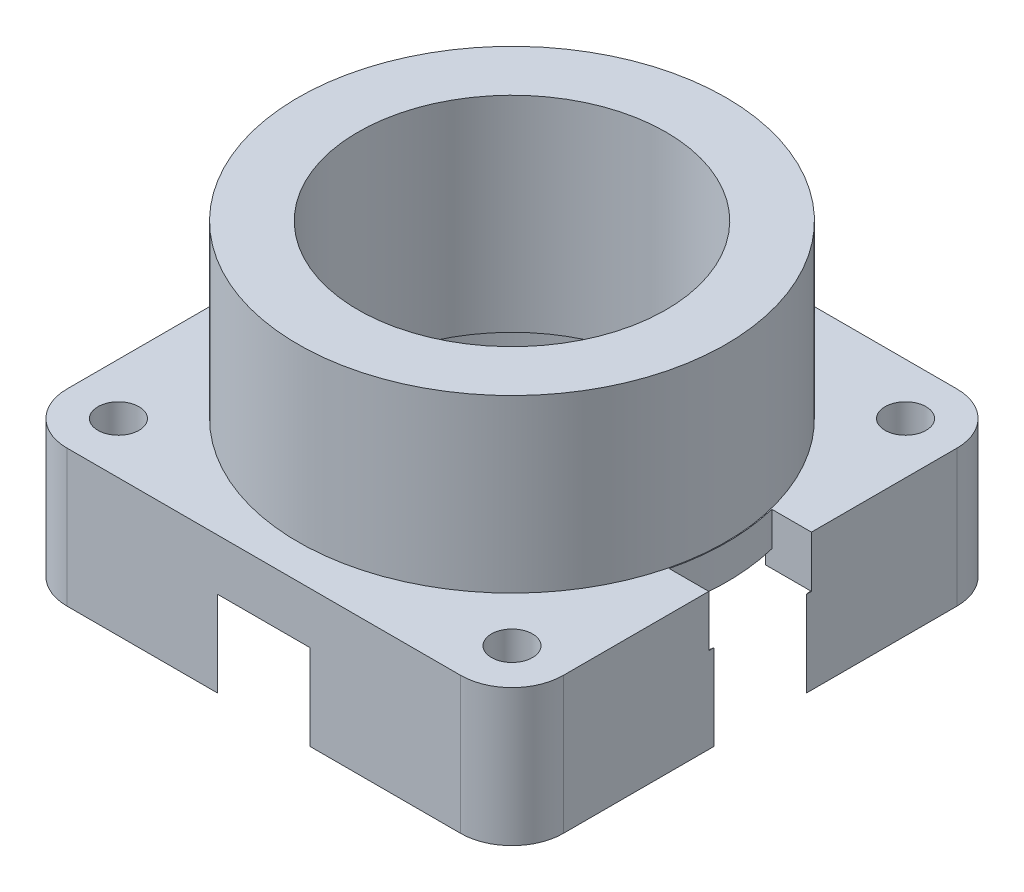
ISO-10303-21;
HEADER;
FILE_DESCRIPTION(('STEP AP214'),'2;1');
FILE_NAME('part.step','',(''),(''),'','','');
FILE_SCHEMA(('AUTOMOTIVE_DESIGN { 1 0 10303 214 1 1 1 1 }'));
ENDSEC;
DATA;
#1=APPLICATION_CONTEXT('core data for automotive mechanical design processes');
#2=APPLICATION_PROTOCOL_DEFINITION('international standard','automotive_design',2000,#1);
#3=PRODUCT_CONTEXT('',#1,'mechanical');
#4=PRODUCT('Part','Part','',(#3));
#5=PRODUCT_RELATED_PRODUCT_CATEGORY('part','',(#4));
#6=PRODUCT_DEFINITION_FORMATION('','',#4);
#7=PRODUCT_DEFINITION_CONTEXT('part definition',#1,'design');
#8=PRODUCT_DEFINITION('design','',#6,#7);
#9=PRODUCT_DEFINITION_SHAPE('','',#8);
#10=(LENGTH_UNIT() NAMED_UNIT(*) SI_UNIT(.MILLI.,.METRE.));
#11=(NAMED_UNIT(*) PLANE_ANGLE_UNIT() SI_UNIT($,.RADIAN.));
#12=(NAMED_UNIT(*) SI_UNIT($,.STERADIAN.) SOLID_ANGLE_UNIT());
#13=UNCERTAINTY_MEASURE_WITH_UNIT(LENGTH_MEASURE(1.E-05),#10,'distance_accuracy_value','');
#14=(GEOMETRIC_REPRESENTATION_CONTEXT(3) GLOBAL_UNCERTAINTY_ASSIGNED_CONTEXT((#13)) GLOBAL_UNIT_ASSIGNED_CONTEXT((#10,
#11,#12)) REPRESENTATION_CONTEXT('',''));
#15=CARTESIAN_POINT('',(0.,0.,0.));
#16=DIRECTION('',(0.,0.,1.));
#17=DIRECTION('',(1.,0.,0.));
#18=AXIS2_PLACEMENT_3D('',#15,#16,#17);
#19=CARTESIAN_POINT('',(0.,-2.,0.));
#20=DIRECTION('',(0.,1.,0.));
#21=DIRECTION('',(0.,0.,1.));
#22=AXIS2_PLACEMENT_3D('',#19,#20,#21);
#23=CYLINDRICAL_SURFACE('',#22,12.2);
#24=CARTESIAN_POINT('',(0.,-8.,0.));
#25=DIRECTION('',(0.,1.,0.));
#26=DIRECTION('',(0.,0.,1.));
#27=AXIS2_PLACEMENT_3D('',#24,#25,#26);
#28=CIRCLE('',#27,12.2);
#29=CARTESIAN_POINT('',(11.8253963992756,-8.,3.));
#30=VERTEX_POINT('',#29);
#31=CARTESIAN_POINT('',(11.8253963992756,-8.,-3.));
#32=VERTEX_POINT('',#31);
#33=EDGE_CURVE('E76',#30,#32,#28,.F.);
#34=ORIENTED_EDGE('',*,*,#33,.F.);
#35=DIRECTION('',(0.,1.,0.));
#36=VECTOR('',#35,1.);
#37=CARTESIAN_POINT('',(11.8253963992756,-2.,3.));
#38=LINE('',#37,#36);
#39=CARTESIAN_POINT('',(11.8253963992756,-9.,3.));
#40=VERTEX_POINT('',#39);
#41=EDGE_CURVE('E253',#30,#40,#38,.F.);
#42=ORIENTED_EDGE('',*,*,#41,.T.);
#43=CARTESIAN_POINT('',(0.,-9.,0.));
#44=DIRECTION('',(0.,1.,0.));
#45=DIRECTION('',(0.,0.,1.));
#46=AXIS2_PLACEMENT_3D('',#43,#44,#45);
#47=CIRCLE('',#46,12.2);
#48=CARTESIAN_POINT('',(11.8253963992756,-9.,-3.));
#49=VERTEX_POINT('',#48);
#50=EDGE_CURVE('E361',#49,#40,#47,.T.);
#51=ORIENTED_EDGE('',*,*,#50,.F.);
#52=DIRECTION('',(0.,1.,0.));
#53=VECTOR('',#52,1.);
#54=CARTESIAN_POINT('',(11.8253963992756,-2.,-3.));
#55=LINE('',#54,#53);
#56=EDGE_CURVE('E245',#49,#32,#55,.T.);
#57=ORIENTED_EDGE('',*,*,#56,.T.);
#58=EDGE_LOOP('',(#34,#42,#51,#57));
#59=FACE_BOUND('',#58,.T.);
#60=ADVANCED_FACE('F53',(#59),#23,.F.);
#61=CARTESIAN_POINT('',(4.5,-6.,3.));
#62=DIRECTION('',(0.,0.,1.));
#63=DIRECTION('',(1.,0.,0.));
#64=AXIS2_PLACEMENT_3D('',#61,#62,#63);
#65=PLANE('',#64);
#66=DIRECTION('',(0.,-1.,0.));
#67=VECTOR('',#66,1.);
#68=CARTESIAN_POINT('',(12.1854903761575,0.,3.));
#69=LINE('',#68,#67);
#70=CARTESIAN_POINT('',(12.1854903761575,-6.,3.));
#71=VERTEX_POINT('',#70);
#72=CARTESIAN_POINT('',(12.1854903761575,-8.,3.));
#73=VERTEX_POINT('',#72);
#74=EDGE_CURVE('E221',#71,#73,#69,.T.);
#75=ORIENTED_EDGE('',*,*,#74,.F.);
#76=DIRECTION('',(1.,0.,0.));
#77=VECTOR('',#76,1.);
#78=CARTESIAN_POINT('',(4.5,-6.,3.));
#79=LINE('',#78,#77);
#80=CARTESIAN_POINT('',(14.5,-6.,3.));
#81=VERTEX_POINT('',#80);
#82=EDGE_CURVE('E243',#71,#81,#79,.T.);
#83=ORIENTED_EDGE('',*,*,#82,.T.);
#84=DIRECTION('',(0.,-1.,0.));
#85=VECTOR('',#84,1.);
#86=CARTESIAN_POINT('',(14.5,-6.,3.));
#87=LINE('',#86,#85);
#88=CARTESIAN_POINT('',(14.5,-9.,3.));
#89=VERTEX_POINT('',#88);
#90=EDGE_CURVE('E234',#81,#89,#87,.T.);
#91=ORIENTED_EDGE('',*,*,#90,.T.);
#92=DIRECTION('',(1.,0.,0.));
#93=VECTOR('',#92,1.);
#94=CARTESIAN_POINT('',(4.5,-9.,3.));
#95=LINE('',#94,#93);
#96=CARTESIAN_POINT('',(14.4416931140362,-9.,3.));
#97=VERTEX_POINT('',#96);
#98=EDGE_CURVE('E242',#97,#89,#95,.T.);
#99=ORIENTED_EDGE('',*,*,#98,.F.);
#100=EDGE_CURVE('E250',#40,#97,#95,.T.);
#101=ORIENTED_EDGE('',*,*,#100,.F.);
#102=ORIENTED_EDGE('',*,*,#41,.F.);
#103=DIRECTION('',(-1.,0.,0.));
#104=VECTOR('',#103,1.);
#105=CARTESIAN_POINT('',(4.5,-8.,3.));
#106=LINE('',#105,#104);
#107=EDGE_CURVE('E68',#73,#30,#106,.T.);
#108=ORIENTED_EDGE('',*,*,#107,.F.);
#109=EDGE_LOOP('',(#75,#83,#91,#99,#101,#102,#108));
#110=FACE_BOUND('',#109,.T.);
#111=ADVANCED_FACE('F437',(#110),#65,.F.);
#112=CARTESIAN_POINT('',(4.5,-6.,-3.));
#113=DIRECTION('',(0.,0.,-1.));
#114=DIRECTION('',(-1.,0.,0.));
#115=AXIS2_PLACEMENT_3D('',#112,#113,#114);
#116=PLANE('',#115);
#117=DIRECTION('',(0.,-1.,0.));
#118=VECTOR('',#117,1.);
#119=CARTESIAN_POINT('',(12.1854903761575,0.,-3.));
#120=LINE('',#119,#118);
#121=CARTESIAN_POINT('',(12.1854903761575,-8.,-3.));
#122=VERTEX_POINT('',#121);
#123=CARTESIAN_POINT('',(12.1854903761575,-6.,-3.));
#124=VERTEX_POINT('',#123);
#125=EDGE_CURVE('E12',#122,#124,#120,.F.);
#126=ORIENTED_EDGE('',*,*,#125,.F.);
#127=DIRECTION('',(1.,0.,0.));
#128=VECTOR('',#127,1.);
#129=CARTESIAN_POINT('',(4.5,-8.,-3.));
#130=LINE('',#129,#128);
#131=EDGE_CURVE('E61',#32,#122,#130,.T.);
#132=ORIENTED_EDGE('',*,*,#131,.F.);
#133=ORIENTED_EDGE('',*,*,#56,.F.);
#134=DIRECTION('',(1.,0.,0.));
#135=VECTOR('',#134,1.);
#136=CARTESIAN_POINT('',(4.5,-9.,-3.));
#137=LINE('',#136,#135);
#138=CARTESIAN_POINT('',(14.4416931140362,-9.,-3.));
#139=VERTEX_POINT('',#138);
#140=EDGE_CURVE('E247',#49,#139,#137,.T.);
#141=ORIENTED_EDGE('',*,*,#140,.T.);
#142=CARTESIAN_POINT('',(14.5,-9.,-3.));
#143=VERTEX_POINT('',#142);
#144=EDGE_CURVE('E248',#139,#143,#137,.T.);
#145=ORIENTED_EDGE('',*,*,#144,.T.);
#146=DIRECTION('',(0.,1.,0.));
#147=VECTOR('',#146,1.);
#148=CARTESIAN_POINT('',(14.5,-6.,-3.));
#149=LINE('',#148,#147);
#150=CARTESIAN_POINT('',(14.5,-6.,-3.));
#151=VERTEX_POINT('',#150);
#152=EDGE_CURVE('E240',#143,#151,#149,.T.);
#153=ORIENTED_EDGE('',*,*,#152,.T.);
#154=DIRECTION('',(1.,0.,0.));
#155=VECTOR('',#154,1.);
#156=CARTESIAN_POINT('',(4.5,-6.,-3.));
#157=LINE('',#156,#155);
#158=EDGE_CURVE('E210',#124,#151,#157,.T.);
#159=ORIENTED_EDGE('',*,*,#158,.F.);
#160=EDGE_LOOP('',(#126,#132,#133,#141,#145,#153,#159));
#161=FACE_BOUND('',#160,.T.);
#162=ADVANCED_FACE('F208',(#161),#116,.F.);
#163=CARTESIAN_POINT('',(14.5,-6.,-14.5));
#164=DIRECTION('',(-1.,0.,0.));
#165=DIRECTION('',(0.,0.,1.));
#166=AXIS2_PLACEMENT_3D('',#163,#164,#165);
#167=PLANE('',#166);
#168=DIRECTION('',(0.,0.,-1.));
#169=VECTOR('',#168,1.);
#170=CARTESIAN_POINT('',(14.5,-6.,-14.5));
#171=LINE('',#170,#169);
#172=CARTESIAN_POINT('',(14.5,-6.,-11.5));
#173=VERTEX_POINT('',#172);
#174=EDGE_CURVE('E354',#151,#173,#171,.T.);
#175=ORIENTED_EDGE('',*,*,#174,.F.);
#176=ORIENTED_EDGE('',*,*,#152,.F.);
#177=DIRECTION('',(0.,0.,-1.));
#178=VECTOR('',#177,1.);
#179=CARTESIAN_POINT('',(14.5,-9.,3.));
#180=LINE('',#179,#178);
#181=CARTESIAN_POINT('',(14.5,-9.,-2.704163456598));
#182=VERTEX_POINT('',#181);
#183=EDGE_CURVE('E237',#182,#143,#180,.T.);
#184=ORIENTED_EDGE('',*,*,#183,.F.);
#185=DIRECTION('',(0.,1.,0.));
#186=VECTOR('',#185,1.);
#187=CARTESIAN_POINT('',(14.5,-14.,-2.70416345659801));
#188=LINE('',#187,#186);
#189=CARTESIAN_POINT('',(14.5,-14.,-2.70416345659801));
#190=VERTEX_POINT('',#189);
#191=EDGE_CURVE('E271',#190,#182,#188,.T.);
#192=ORIENTED_EDGE('',*,*,#191,.F.);
#193=DIRECTION('',(0.,0.,-1.));
#194=VECTOR('',#193,1.);
#195=CARTESIAN_POINT('',(14.5,-14.,-2.70416345659801));
#196=LINE('',#195,#194);
#197=CARTESIAN_POINT('',(14.5,-14.,-11.5));
#198=VERTEX_POINT('',#197);
#199=EDGE_CURVE('E259',#190,#198,#196,.T.);
#200=ORIENTED_EDGE('',*,*,#199,.T.);
#201=DIRECTION('',(0.,-1.,0.));
#202=VECTOR('',#201,1.);
#203=CARTESIAN_POINT('',(14.5,-6.,-11.5));
#204=LINE('',#203,#202);
#205=EDGE_CURVE('E380',#198,#173,#204,.F.);
#206=ORIENTED_EDGE('',*,*,#205,.T.);
#207=EDGE_LOOP('',(#175,#176,#184,#192,#200,#206));
#208=FACE_BOUND('',#207,.T.);
#209=ADVANCED_FACE('F446',(#208),#167,.F.);
#210=CARTESIAN_POINT('',(0.,-9.,0.));
#211=DIRECTION('',(0.,1.,0.));
#212=DIRECTION('',(0.,0.,1.));
#213=AXIS2_PLACEMENT_3D('',#210,#211,#212);
#214=PLANE('',#213);
#215=ORIENTED_EDGE('',*,*,#50,.T.);
#216=ORIENTED_EDGE('',*,*,#100,.T.);
#217=CARTESIAN_POINT('',(0.,-9.,0.));
#218=DIRECTION('',(0.,-1.,0.));
#219=DIRECTION('',(0.,0.,1.));
#220=AXIS2_PLACEMENT_3D('',#217,#218,#219);
#221=CIRCLE('',#220,14.75);
#222=CARTESIAN_POINT('',(2.70416345659801,-9.,14.5));
#223=VERTEX_POINT('',#222);
#224=EDGE_CURVE('E279',#97,#223,#221,.T.);
#225=ORIENTED_EDGE('',*,*,#224,.T.);
#226=DIRECTION('',(1.,0.,0.));
#227=VECTOR('',#226,1.);
#228=CARTESIAN_POINT('',(-14.5,-9.,14.5));
#229=LINE('',#228,#227);
#230=CARTESIAN_POINT('',(-2.70416345659801,-9.,14.5));
#231=VERTEX_POINT('',#230);
#232=EDGE_CURVE('E364',#231,#223,#229,.T.);
#233=ORIENTED_EDGE('',*,*,#232,.F.);
#234=CARTESIAN_POINT('',(0.,-9.,0.));
#235=DIRECTION('',(0.,-1.,0.));
#236=DIRECTION('',(0.,0.,1.));
#237=AXIS2_PLACEMENT_3D('',#234,#235,#236);
#238=CIRCLE('',#237,14.75);
#239=CARTESIAN_POINT('',(-14.5,-9.,2.70416345659801));
#240=VERTEX_POINT('',#239);
#241=EDGE_CURVE('E299',#231,#240,#238,.T.);
#242=ORIENTED_EDGE('',*,*,#241,.T.);
#243=DIRECTION('',(0.,0.,1.));
#244=VECTOR('',#243,1.);
#245=CARTESIAN_POINT('',(-14.5,-9.,-14.5));
#246=LINE('',#245,#244);
#247=CARTESIAN_POINT('',(-14.5,-9.,-2.70416345659801));
#248=VERTEX_POINT('',#247);
#249=EDGE_CURVE('E346',#248,#240,#246,.T.);
#250=ORIENTED_EDGE('',*,*,#249,.F.);
#251=CARTESIAN_POINT('',(0.,-9.,0.));
#252=DIRECTION('',(0.,-1.,0.));
#253=DIRECTION('',(0.,0.,1.));
#254=AXIS2_PLACEMENT_3D('',#251,#252,#253);
#255=CIRCLE('',#254,14.75);
#256=CARTESIAN_POINT('',(-2.70416345659801,-9.,-14.5));
#257=VERTEX_POINT('',#256);
#258=EDGE_CURVE('E318',#248,#257,#255,.T.);
#259=ORIENTED_EDGE('',*,*,#258,.T.);
#260=DIRECTION('',(-1.,0.,0.));
#261=VECTOR('',#260,1.);
#262=CARTESIAN_POINT('',(-14.5,-9.,-14.5));
#263=LINE('',#262,#261);
#264=CARTESIAN_POINT('',(2.704163456598,-9.,-14.5));
#265=VERTEX_POINT('',#264);
#266=EDGE_CURVE('E351',#265,#257,#263,.T.);
#267=ORIENTED_EDGE('',*,*,#266,.F.);
#268=CARTESIAN_POINT('',(0.,-9.,0.));
#269=DIRECTION('',(0.,-1.,0.));
#270=DIRECTION('',(0.,0.,1.));
#271=AXIS2_PLACEMENT_3D('',#268,#269,#270);
#272=CIRCLE('',#271,14.75);
#273=EDGE_CURVE('E263',#265,#139,#272,.T.);
#274=ORIENTED_EDGE('',*,*,#273,.T.);
#275=ORIENTED_EDGE('',*,*,#140,.F.);
#276=EDGE_LOOP('',(#215,#216,#225,#233,#242,#250,#259,#267,#274,#275));
#277=FACE_BOUND('',#276,.T.);
#278=ADVANCED_FACE('F473',(#277),#214,.F.);
#279=CARTESIAN_POINT('',(0.,-6.,0.));
#280=DIRECTION('',(0.,1.,0.));
#281=DIRECTION('',(0.,0.,1.));
#282=AXIS2_PLACEMENT_3D('',#279,#280,#281);
#283=PLANE('',#282);
#284=ORIENTED_EDGE('',*,*,#82,.F.);
#285=CARTESIAN_POINT('',(0.,-6.,0.));
#286=DIRECTION('',(0.,-1.,0.));
#287=DIRECTION('',(0.,0.,-1.));
#288=AXIS2_PLACEMENT_3D('',#285,#286,#287);
#289=CIRCLE('',#288,12.5493496129252);
#290=EDGE_CURVE('E222',#124,#71,#289,.T.);
#291=ORIENTED_EDGE('',*,*,#290,.F.);
#292=ORIENTED_EDGE('',*,*,#158,.T.);
#293=ORIENTED_EDGE('',*,*,#174,.T.);
#294=CARTESIAN_POINT('',(11.5,-6.,-11.5));
#295=DIRECTION('',(0.,1.,0.));
#296=DIRECTION('',(0.,0.,1.));
#297=AXIS2_PLACEMENT_3D('',#294,#295,#296);
#298=CIRCLE('',#297,3.);
#299=CARTESIAN_POINT('',(11.5,-6.,-14.5));
#300=VERTEX_POINT('',#299);
#301=EDGE_CURVE('E389',#173,#300,#298,.T.);
#302=ORIENTED_EDGE('',*,*,#301,.T.);
#303=DIRECTION('',(-1.,0.,0.));
#304=VECTOR('',#303,1.);
#305=CARTESIAN_POINT('',(-14.5,-6.,-14.5));
#306=LINE('',#305,#304);
#307=CARTESIAN_POINT('',(-11.5,-6.,-14.5));
#308=VERTEX_POINT('',#307);
#309=EDGE_CURVE('E358',#300,#308,#306,.T.);
#310=ORIENTED_EDGE('',*,*,#309,.T.);
#311=CARTESIAN_POINT('',(-11.5,-6.,-11.5));
#312=DIRECTION('',(0.,1.,0.));
#313=DIRECTION('',(0.,0.,1.));
#314=AXIS2_PLACEMENT_3D('',#311,#312,#313);
#315=CIRCLE('',#314,3.);
#316=CARTESIAN_POINT('',(-14.5,-6.,-11.5));
#317=VERTEX_POINT('',#316);
#318=EDGE_CURVE('E385',#308,#317,#315,.T.);
#319=ORIENTED_EDGE('',*,*,#318,.T.);
#320=DIRECTION('',(0.,0.,1.));
#321=VECTOR('',#320,1.);
#322=CARTESIAN_POINT('',(-14.5,-6.,-14.5));
#323=LINE('',#322,#321);
#324=CARTESIAN_POINT('',(-14.5,-6.,11.5));
#325=VERTEX_POINT('',#324);
#326=EDGE_CURVE('E347',#317,#325,#323,.T.);
#327=ORIENTED_EDGE('',*,*,#326,.T.);
#328=CARTESIAN_POINT('',(-11.5,-6.,11.5));
#329=DIRECTION('',(0.,1.,0.));
#330=DIRECTION('',(0.,0.,1.));
#331=AXIS2_PLACEMENT_3D('',#328,#329,#330);
#332=CIRCLE('',#331,3.);
#333=CARTESIAN_POINT('',(-11.5,-6.,14.5));
#334=VERTEX_POINT('',#333);
#335=EDGE_CURVE('E383',#325,#334,#332,.T.);
#336=ORIENTED_EDGE('',*,*,#335,.T.);
#337=DIRECTION('',(1.,0.,0.));
#338=VECTOR('',#337,1.);
#339=CARTESIAN_POINT('',(-14.5,-6.,14.5));
#340=LINE('',#339,#338);
#341=CARTESIAN_POINT('',(11.5,-6.,14.5));
#342=VERTEX_POINT('',#341);
#343=EDGE_CURVE('E350',#334,#342,#340,.T.);
#344=ORIENTED_EDGE('',*,*,#343,.T.);
#345=CARTESIAN_POINT('',(11.5,-6.,11.5));
#346=DIRECTION('',(0.,1.,0.));
#347=DIRECTION('',(0.,0.,1.));
#348=AXIS2_PLACEMENT_3D('',#345,#346,#347);
#349=CIRCLE('',#348,3.);
#350=CARTESIAN_POINT('',(14.5,-6.,11.5));
#351=VERTEX_POINT('',#350);
#352=EDGE_CURVE('E387',#342,#351,#349,.T.);
#353=ORIENTED_EDGE('',*,*,#352,.T.);
#354=EDGE_CURVE('E355',#351,#81,#171,.T.);
#355=ORIENTED_EDGE('',*,*,#354,.T.);
#356=EDGE_LOOP('',(#284,#291,#292,#293,#302,#310,#319,#327,#336,#344,#353,#355));
#357=FACE_BOUND('',#356,.T.);
#358=CARTESIAN_POINT('',(11.5,-6.,11.5));
#359=DIRECTION('',(0.,1.,0.));
#360=DIRECTION('',(0.,0.,1.));
#361=AXIS2_PLACEMENT_3D('',#358,#359,#360);
#362=CIRCLE('',#361,1.2);
#363=CARTESIAN_POINT('',(11.5,-6.,12.7));
#364=VERTEX_POINT('',#363);
#365=EDGE_CURVE('E337',#364,#364,#362,.T.);
#366=ORIENTED_EDGE('',*,*,#365,.F.);
#367=EDGE_LOOP('',(#366));
#368=FACE_BOUND('',#367,.T.);
#369=CARTESIAN_POINT('',(-11.5,-6.,-11.5));
#370=DIRECTION('',(0.,1.,0.));
#371=DIRECTION('',(0.,0.,1.));
#372=AXIS2_PLACEMENT_3D('',#369,#370,#371);
#373=CIRCLE('',#372,1.2);
#374=CARTESIAN_POINT('',(-11.5,-6.,-10.3));
#375=VERTEX_POINT('',#374);
#376=EDGE_CURVE('E343',#375,#375,#373,.T.);
#377=ORIENTED_EDGE('',*,*,#376,.F.);
#378=EDGE_LOOP('',(#377));
#379=FACE_BOUND('',#378,.T.);
#380=CARTESIAN_POINT('',(11.5,-6.,-11.5));
#381=DIRECTION('',(0.,1.,0.));
#382=DIRECTION('',(0.,0.,-1.));
#383=AXIS2_PLACEMENT_3D('',#380,#381,#382);
#384=CIRCLE('',#383,1.2);
#385=CARTESIAN_POINT('',(11.5,-6.,-12.7));
#386=VERTEX_POINT('',#385);
#387=EDGE_CURVE('E340',#386,#386,#384,.T.);
#388=ORIENTED_EDGE('',*,*,#387,.F.);
#389=EDGE_LOOP('',(#388));
#390=FACE_BOUND('',#389,.T.);
#391=CARTESIAN_POINT('',(-11.5,-6.,11.5));
#392=DIRECTION('',(0.,1.,0.));
#393=DIRECTION('',(0.,0.,-1.));
#394=AXIS2_PLACEMENT_3D('',#391,#392,#393);
#395=CIRCLE('',#394,1.2);
#396=CARTESIAN_POINT('',(-11.5,-6.,10.3));
#397=VERTEX_POINT('',#396);
#398=EDGE_CURVE('E332',#397,#397,#395,.T.);
#399=ORIENTED_EDGE('',*,*,#398,.F.);
#400=EDGE_LOOP('',(#399));
#401=FACE_BOUND('',#400,.T.);
#402=CARTESIAN_POINT('',(0.,-6.,0.));
#403=DIRECTION('',(0.,-1.,0.));
#404=DIRECTION('',(0.,0.,-1.));
#405=AXIS2_PLACEMENT_3D('',#402,#403,#404);
#406=CIRCLE('',#405,12.5);
#407=CARTESIAN_POINT('',(0.,-6.,-12.5));
#408=VERTEX_POINT('',#407);
#409=EDGE_CURVE('E667',#408,#408,#406,.T.);
#410=ORIENTED_EDGE('',*,*,#409,.T.);
#411=EDGE_LOOP('',(#410));
#412=FACE_BOUND('',#411,.T.);
#413=ADVANCED_FACE('F420',(#357,#368,#379,#390,#401,#412),#283,.T.);
#414=CARTESIAN_POINT('',(-14.5,-6.,-14.5));
#415=DIRECTION('',(1.,0.,0.));
#416=DIRECTION('',(0.,0.,-1.));
#417=AXIS2_PLACEMENT_3D('',#414,#415,#416);
#418=PLANE('',#417);
#419=ORIENTED_EDGE('',*,*,#326,.F.);
#420=DIRECTION('',(0.,-1.,0.));
#421=VECTOR('',#420,1.);
#422=CARTESIAN_POINT('',(-14.5,-6.,-11.5));
#423=LINE('',#422,#421);
#424=CARTESIAN_POINT('',(-14.5,-14.,-11.5));
#425=VERTEX_POINT('',#424);
#426=EDGE_CURVE('E400',#317,#425,#423,.T.);
#427=ORIENTED_EDGE('',*,*,#426,.T.);
#428=DIRECTION('',(0.,0.,1.));
#429=VECTOR('',#428,1.);
#430=CARTESIAN_POINT('',(-14.5,-14.,-14.5));
#431=LINE('',#430,#429);
#432=CARTESIAN_POINT('',(-14.5,-14.,-2.70416345659801));
#433=VERTEX_POINT('',#432);
#434=EDGE_CURVE('E325',#425,#433,#431,.T.);
#435=ORIENTED_EDGE('',*,*,#434,.T.);
#436=DIRECTION('',(0.,1.,0.));
#437=VECTOR('',#436,1.);
#438=CARTESIAN_POINT('',(-14.5,-14.,-2.70416345659801));
#439=LINE('',#438,#437);
#440=EDGE_CURVE('E330',#433,#248,#439,.T.);
#441=ORIENTED_EDGE('',*,*,#440,.T.);
#442=ORIENTED_EDGE('',*,*,#249,.T.);
#443=DIRECTION('',(0.,1.,0.));
#444=VECTOR('',#443,1.);
#445=CARTESIAN_POINT('',(-14.5,-14.,2.70416345659801));
#446=LINE('',#445,#444);
#447=CARTESIAN_POINT('',(-14.5,-14.,2.70416345659801));
#448=VERTEX_POINT('',#447);
#449=EDGE_CURVE('E308',#448,#240,#446,.T.);
#450=ORIENTED_EDGE('',*,*,#449,.F.);
#451=DIRECTION('',(0.,0.,1.));
#452=VECTOR('',#451,1.);
#453=CARTESIAN_POINT('',(-14.5,-14.,2.70416345659801));
#454=LINE('',#453,#452);
#455=CARTESIAN_POINT('',(-14.5,-14.,11.5));
#456=VERTEX_POINT('',#455);
#457=EDGE_CURVE('E303',#448,#456,#454,.T.);
#458=ORIENTED_EDGE('',*,*,#457,.T.);
#459=DIRECTION('',(0.,-1.,0.));
#460=VECTOR('',#459,1.);
#461=CARTESIAN_POINT('',(-14.5,-6.,11.5));
#462=LINE('',#461,#460);
#463=EDGE_CURVE('E398',#456,#325,#462,.F.);
#464=ORIENTED_EDGE('',*,*,#463,.T.);
#465=EDGE_LOOP('',(#419,#427,#435,#441,#442,#450,#458,#464));
#466=FACE_BOUND('',#465,.T.);
#467=ADVANCED_FACE('F415',(#466),#418,.F.);
#468=CARTESIAN_POINT('',(-14.5,-6.,14.5));
#469=DIRECTION('',(0.,0.,-1.));
#470=DIRECTION('',(-1.,0.,0.));
#471=AXIS2_PLACEMENT_3D('',#468,#469,#470);
#472=PLANE('',#471);
#473=DIRECTION('',(1.,0.,0.));
#474=VECTOR('',#473,1.);
#475=CARTESIAN_POINT('',(2.70416345659801,-14.,14.5));
#476=LINE('',#475,#474);
#477=CARTESIAN_POINT('',(2.70416345659801,-14.,14.5));
#478=VERTEX_POINT('',#477);
#479=CARTESIAN_POINT('',(11.5,-14.,14.5));
#480=VERTEX_POINT('',#479);
#481=EDGE_CURVE('E283',#478,#480,#476,.T.);
#482=ORIENTED_EDGE('',*,*,#481,.T.);
#483=DIRECTION('',(0.,-1.,0.));
#484=VECTOR('',#483,1.);
#485=CARTESIAN_POINT('',(11.5,-6.,14.5));
#486=LINE('',#485,#484);
#487=EDGE_CURVE('E396',#480,#342,#486,.F.);
#488=ORIENTED_EDGE('',*,*,#487,.T.);
#489=ORIENTED_EDGE('',*,*,#343,.F.);
#490=DIRECTION('',(0.,-1.,0.));
#491=VECTOR('',#490,1.);
#492=CARTESIAN_POINT('',(-11.5,-6.,14.5));
#493=LINE('',#492,#491);
#494=CARTESIAN_POINT('',(-11.5,-14.,14.5));
#495=VERTEX_POINT('',#494);
#496=EDGE_CURVE('E393',#334,#495,#493,.T.);
#497=ORIENTED_EDGE('',*,*,#496,.T.);
#498=DIRECTION('',(1.,0.,0.));
#499=VECTOR('',#498,1.);
#500=CARTESIAN_POINT('',(-14.5,-14.,14.5));
#501=LINE('',#500,#499);
#502=CARTESIAN_POINT('',(-2.70416345659801,-14.,14.5));
#503=VERTEX_POINT('',#502);
#504=EDGE_CURVE('E306',#495,#503,#501,.T.);
#505=ORIENTED_EDGE('',*,*,#504,.T.);
#506=DIRECTION('',(0.,1.,0.));
#507=VECTOR('',#506,1.);
#508=CARTESIAN_POINT('',(-2.70416345659801,-14.,14.5));
#509=LINE('',#508,#507);
#510=EDGE_CURVE('E311',#503,#231,#509,.T.);
#511=ORIENTED_EDGE('',*,*,#510,.T.);
#512=ORIENTED_EDGE('',*,*,#232,.T.);
#513=DIRECTION('',(0.,1.,0.));
#514=VECTOR('',#513,1.);
#515=CARTESIAN_POINT('',(2.70416345659801,-14.,14.5));
#516=LINE('',#515,#514);
#517=EDGE_CURVE('E289',#478,#223,#516,.T.);
#518=ORIENTED_EDGE('',*,*,#517,.F.);
#519=EDGE_LOOP('',(#482,#488,#489,#497,#505,#511,#512,#518));
#520=FACE_BOUND('',#519,.T.);
#521=ADVANCED_FACE('F424',(#520),#472,.F.);
#522=CARTESIAN_POINT('',(14.5,-9.,2.704163456598));
#523=VERTEX_POINT('',#522);
#524=EDGE_CURVE('E238',#89,#523,#180,.T.);
#525=ORIENTED_EDGE('',*,*,#524,.F.);
#526=ORIENTED_EDGE('',*,*,#90,.F.);
#527=ORIENTED_EDGE('',*,*,#354,.F.);
#528=DIRECTION('',(0.,-1.,0.));
#529=VECTOR('',#528,1.);
#530=CARTESIAN_POINT('',(14.5,-6.,11.5));
#531=LINE('',#530,#529);
#532=CARTESIAN_POINT('',(14.5,-14.,11.5));
#533=VERTEX_POINT('',#532);
#534=EDGE_CURVE('E377',#351,#533,#531,.T.);
#535=ORIENTED_EDGE('',*,*,#534,.T.);
#536=DIRECTION('',(0.,0.,-1.));
#537=VECTOR('',#536,1.);
#538=CARTESIAN_POINT('',(14.5,-14.,14.5));
#539=LINE('',#538,#537);
#540=CARTESIAN_POINT('',(14.5,-14.,2.70416345659801));
#541=VERTEX_POINT('',#540);
#542=EDGE_CURVE('E287',#533,#541,#539,.T.);
#543=ORIENTED_EDGE('',*,*,#542,.T.);
#544=DIRECTION('',(0.,1.,0.));
#545=VECTOR('',#544,1.);
#546=CARTESIAN_POINT('',(14.5,-14.,2.70416345659801));
#547=LINE('',#546,#545);
#548=EDGE_CURVE('E291',#541,#523,#547,.T.);
#549=ORIENTED_EDGE('',*,*,#548,.T.);
#550=EDGE_LOOP('',(#525,#526,#527,#535,#543,#549));
#551=FACE_BOUND('',#550,.T.);
#552=ADVANCED_FACE('F434',(#551),#167,.F.);
#553=CARTESIAN_POINT('',(-14.5,-6.,-14.5));
#554=DIRECTION('',(0.,0.,1.));
#555=DIRECTION('',(1.,0.,0.));
#556=AXIS2_PLACEMENT_3D('',#553,#554,#555);
#557=PLANE('',#556);
#558=ORIENTED_EDGE('',*,*,#309,.F.);
#559=DIRECTION('',(0.,-1.,0.));
#560=VECTOR('',#559,1.);
#561=CARTESIAN_POINT('',(11.5,-6.,-14.5));
#562=LINE('',#561,#560);
#563=CARTESIAN_POINT('',(11.5,-14.,-14.5));
#564=VERTEX_POINT('',#563);
#565=EDGE_CURVE('E372',#300,#564,#562,.T.);
#566=ORIENTED_EDGE('',*,*,#565,.T.);
#567=DIRECTION('',(-1.,0.,0.));
#568=VECTOR('',#567,1.);
#569=CARTESIAN_POINT('',(14.5,-14.,-14.5));
#570=LINE('',#569,#568);
#571=CARTESIAN_POINT('',(2.70416345659801,-14.,-14.5));
#572=VERTEX_POINT('',#571);
#573=EDGE_CURVE('E262',#564,#572,#570,.T.);
#574=ORIENTED_EDGE('',*,*,#573,.T.);
#575=DIRECTION('',(0.,1.,0.));
#576=VECTOR('',#575,1.);
#577=CARTESIAN_POINT('',(2.70416345659801,-14.,-14.5));
#578=LINE('',#577,#576);
#579=EDGE_CURVE('E268',#572,#265,#578,.T.);
#580=ORIENTED_EDGE('',*,*,#579,.T.);
#581=ORIENTED_EDGE('',*,*,#266,.T.);
#582=DIRECTION('',(0.,1.,0.));
#583=VECTOR('',#582,1.);
#584=CARTESIAN_POINT('',(-2.70416345659801,-14.,-14.5));
#585=LINE('',#584,#583);
#586=CARTESIAN_POINT('',(-2.70416345659801,-14.,-14.5));
#587=VERTEX_POINT('',#586);
#588=EDGE_CURVE('E327',#587,#257,#585,.T.);
#589=ORIENTED_EDGE('',*,*,#588,.F.);
#590=DIRECTION('',(-1.,0.,0.));
#591=VECTOR('',#590,1.);
#592=CARTESIAN_POINT('',(-2.70416345659801,-14.,-14.5));
#593=LINE('',#592,#591);
#594=CARTESIAN_POINT('',(-11.5,-14.,-14.5));
#595=VERTEX_POINT('',#594);
#596=EDGE_CURVE('E322',#587,#595,#593,.T.);
#597=ORIENTED_EDGE('',*,*,#596,.T.);
#598=DIRECTION('',(0.,-1.,0.));
#599=VECTOR('',#598,1.);
#600=CARTESIAN_POINT('',(-11.5,-6.,-14.5));
#601=LINE('',#600,#599);
#602=EDGE_CURVE('E370',#595,#308,#601,.F.);
#603=ORIENTED_EDGE('',*,*,#602,.T.);
#604=EDGE_LOOP('',(#558,#566,#574,#580,#581,#589,#597,#603));
#605=FACE_BOUND('',#604,.T.);
#606=ADVANCED_FACE('F456',(#605),#557,.F.);
#607=CARTESIAN_POINT('',(-11.5,-6.,-11.5));
#608=DIRECTION('',(0.,-1.,0.));
#609=DIRECTION('',(0.,0.,-1.));
#610=AXIS2_PLACEMENT_3D('',#607,#608,#609);
#611=CYLINDRICAL_SURFACE('',#610,1.2);
#612=ORIENTED_EDGE('',*,*,#376,.T.);
#613=EDGE_LOOP('',(#612));
#614=FACE_BOUND('',#613,.T.);
#615=CARTESIAN_POINT('',(-11.5,-14.,-11.5));
#616=DIRECTION('',(0.,1.,0.));
#617=DIRECTION('',(0.,0.,1.));
#618=AXIS2_PLACEMENT_3D('',#615,#616,#617);
#619=CIRCLE('',#618,1.2);
#620=CARTESIAN_POINT('',(-11.5,-14.,-10.3));
#621=VERTEX_POINT('',#620);
#622=EDGE_CURVE('E314',#621,#621,#619,.T.);
#623=ORIENTED_EDGE('',*,*,#622,.F.);
#624=EDGE_LOOP('',(#623));
#625=FACE_BOUND('',#624,.T.);
#626=ADVANCED_FACE('F696',(#614,#625),#611,.F.);
#627=CARTESIAN_POINT('',(11.5,-6.,-11.5));
#628=DIRECTION('',(0.,-1.,0.));
#629=DIRECTION('',(0.,0.,-1.));
#630=AXIS2_PLACEMENT_3D('',#627,#628,#629);
#631=CYLINDRICAL_SURFACE('',#630,1.2);
#632=ORIENTED_EDGE('',*,*,#387,.T.);
#633=EDGE_LOOP('',(#632));
#634=FACE_BOUND('',#633,.T.);
#635=CARTESIAN_POINT('',(11.5,-14.,-11.5));
#636=DIRECTION('',(0.,1.,0.));
#637=DIRECTION('',(0.,0.,1.));
#638=AXIS2_PLACEMENT_3D('',#635,#636,#637);
#639=CIRCLE('',#638,1.2);
#640=CARTESIAN_POINT('',(11.5,-14.,-10.3));
#641=VERTEX_POINT('',#640);
#642=EDGE_CURVE('E255',#641,#641,#639,.T.);
#643=ORIENTED_EDGE('',*,*,#642,.F.);
#644=EDGE_LOOP('',(#643));
#645=FACE_BOUND('',#644,.T.);
#646=ADVANCED_FACE('F759',(#634,#645),#631,.F.);
#647=CARTESIAN_POINT('',(11.5,-6.,11.5));
#648=DIRECTION('',(0.,-1.,0.));
#649=DIRECTION('',(0.,0.,-1.));
#650=AXIS2_PLACEMENT_3D('',#647,#648,#649);
#651=CYLINDRICAL_SURFACE('',#650,1.2);
#652=ORIENTED_EDGE('',*,*,#365,.T.);
#653=EDGE_LOOP('',(#652));
#654=FACE_BOUND('',#653,.T.);
#655=CARTESIAN_POINT('',(11.5,-14.,11.5));
#656=DIRECTION('',(0.,1.,0.));
#657=DIRECTION('',(0.,0.,1.));
#658=AXIS2_PLACEMENT_3D('',#655,#656,#657);
#659=CIRCLE('',#658,1.2);
#660=CARTESIAN_POINT('',(11.5,-14.,12.7));
#661=VERTEX_POINT('',#660);
#662=EDGE_CURVE('E274',#661,#661,#659,.T.);
#663=ORIENTED_EDGE('',*,*,#662,.F.);
#664=EDGE_LOOP('',(#663));
#665=FACE_BOUND('',#664,.T.);
#666=ADVANCED_FACE('F755',(#654,#665),#651,.F.);
#667=CARTESIAN_POINT('',(-11.5,-6.,11.5));
#668=DIRECTION('',(0.,-1.,0.));
#669=DIRECTION('',(0.,0.,-1.));
#670=AXIS2_PLACEMENT_3D('',#667,#668,#669);
#671=CYLINDRICAL_SURFACE('',#670,1.2);
#672=ORIENTED_EDGE('',*,*,#398,.T.);
#673=EDGE_LOOP('',(#672));
#674=FACE_BOUND('',#673,.T.);
#675=CARTESIAN_POINT('',(-11.5,-14.,11.5));
#676=DIRECTION('',(0.,1.,0.));
#677=DIRECTION('',(0.,0.,1.));
#678=AXIS2_PLACEMENT_3D('',#675,#676,#677);
#679=CIRCLE('',#678,1.2);
#680=CARTESIAN_POINT('',(-11.5,-14.,12.7));
#681=VERTEX_POINT('',#680);
#682=EDGE_CURVE('E294',#681,#681,#679,.T.);
#683=ORIENTED_EDGE('',*,*,#682,.F.);
#684=EDGE_LOOP('',(#683));
#685=FACE_BOUND('',#684,.T.);
#686=ADVANCED_FACE('F752',(#674,#685),#671,.F.);
#687=CARTESIAN_POINT('',(0.,-14.,0.));
#688=DIRECTION('',(0.,1.,0.));
#689=DIRECTION('',(0.,0.,1.));
#690=AXIS2_PLACEMENT_3D('',#687,#688,#689);
#691=CYLINDRICAL_SURFACE('',#690,14.75);
#692=ORIENTED_EDGE('',*,*,#258,.F.);
#693=ORIENTED_EDGE('',*,*,#440,.F.);
#694=CARTESIAN_POINT('',(0.,-14.,0.));
#695=DIRECTION('',(0.,-1.,0.));
#696=DIRECTION('',(0.,0.,1.));
#697=AXIS2_PLACEMENT_3D('',#694,#695,#696);
#698=CIRCLE('',#697,14.75);
#699=EDGE_CURVE('E319',#433,#587,#698,.T.);
#700=ORIENTED_EDGE('',*,*,#699,.T.);
#701=ORIENTED_EDGE('',*,*,#588,.T.);
#702=EDGE_LOOP('',(#692,#693,#700,#701));
#703=FACE_BOUND('',#702,.T.);
#704=ADVANCED_FACE('F470',(#703),#691,.F.);
#705=CARTESIAN_POINT('',(0.,-14.,0.));
#706=DIRECTION('',(0.,1.,0.));
#707=DIRECTION('',(0.,0.,1.));
#708=AXIS2_PLACEMENT_3D('',#705,#706,#707);
#709=PLANE('',#708);
#710=ORIENTED_EDGE('',*,*,#622,.T.);
#711=EDGE_LOOP('',(#710));
#712=FACE_BOUND('',#711,.T.);
#713=ORIENTED_EDGE('',*,*,#434,.F.);
#714=CARTESIAN_POINT('',(-11.5,-14.,-11.5));
#715=DIRECTION('',(0.,1.,0.));
#716=DIRECTION('',(0.,0.,1.));
#717=AXIS2_PLACEMENT_3D('',#714,#715,#716);
#718=CIRCLE('',#717,3.);
#719=EDGE_CURVE('E403',#425,#595,#718,.F.);
#720=ORIENTED_EDGE('',*,*,#719,.T.);
#721=ORIENTED_EDGE('',*,*,#596,.F.);
#722=ORIENTED_EDGE('',*,*,#699,.F.);
#723=EDGE_LOOP('',(#713,#720,#721,#722));
#724=FACE_BOUND('',#723,.T.);
#725=ADVANCED_FACE('F467',(#712,#724),#709,.F.);
#726=CARTESIAN_POINT('',(0.,-14.,0.));
#727=DIRECTION('',(0.,1.,0.));
#728=DIRECTION('',(0.,0.,1.));
#729=AXIS2_PLACEMENT_3D('',#726,#727,#728);
#730=CYLINDRICAL_SURFACE('',#729,14.75);
#731=ORIENTED_EDGE('',*,*,#241,.F.);
#732=ORIENTED_EDGE('',*,*,#510,.F.);
#733=CARTESIAN_POINT('',(0.,-14.,0.));
#734=DIRECTION('',(0.,-1.,0.));
#735=DIRECTION('',(0.,0.,1.));
#736=AXIS2_PLACEMENT_3D('',#733,#734,#735);
#737=CIRCLE('',#736,14.75);
#738=EDGE_CURVE('E300',#503,#448,#737,.T.);
#739=ORIENTED_EDGE('',*,*,#738,.T.);
#740=ORIENTED_EDGE('',*,*,#449,.T.);
#741=EDGE_LOOP('',(#731,#732,#739,#740));
#742=FACE_BOUND('',#741,.T.);
#743=ADVANCED_FACE('F478',(#742),#730,.F.);
#744=CARTESIAN_POINT('',(0.,-14.,0.));
#745=DIRECTION('',(0.,1.,0.));
#746=DIRECTION('',(0.,0.,1.));
#747=AXIS2_PLACEMENT_3D('',#744,#745,#746);
#748=PLANE('',#747);
#749=ORIENTED_EDGE('',*,*,#682,.T.);
#750=EDGE_LOOP('',(#749));
#751=FACE_BOUND('',#750,.T.);
#752=ORIENTED_EDGE('',*,*,#504,.F.);
#753=CARTESIAN_POINT('',(-11.5,-14.,11.5));
#754=DIRECTION('',(0.,1.,0.));
#755=DIRECTION('',(0.,0.,1.));
#756=AXIS2_PLACEMENT_3D('',#753,#754,#755);
#757=CIRCLE('',#756,3.);
#758=EDGE_CURVE('E219',#495,#456,#757,.F.);
#759=ORIENTED_EDGE('',*,*,#758,.T.);
#760=ORIENTED_EDGE('',*,*,#457,.F.);
#761=ORIENTED_EDGE('',*,*,#738,.F.);
#762=EDGE_LOOP('',(#752,#759,#760,#761));
#763=FACE_BOUND('',#762,.T.);
#764=ADVANCED_FACE('F408',(#751,#763),#748,.F.);
#765=CARTESIAN_POINT('',(0.,-14.,0.));
#766=DIRECTION('',(0.,1.,0.));
#767=DIRECTION('',(0.,0.,1.));
#768=AXIS2_PLACEMENT_3D('',#765,#766,#767);
#769=CYLINDRICAL_SURFACE('',#768,14.75);
#770=EDGE_CURVE('E284',#523,#97,#221,.T.);
#771=ORIENTED_EDGE('',*,*,#770,.F.);
#772=ORIENTED_EDGE('',*,*,#548,.F.);
#773=CARTESIAN_POINT('',(0.,-14.,0.));
#774=DIRECTION('',(0.,-1.,0.));
#775=DIRECTION('',(0.,0.,1.));
#776=AXIS2_PLACEMENT_3D('',#773,#774,#775);
#777=CIRCLE('',#776,14.75);
#778=EDGE_CURVE('E280',#541,#478,#777,.T.);
#779=ORIENTED_EDGE('',*,*,#778,.T.);
#780=ORIENTED_EDGE('',*,*,#517,.T.);
#781=ORIENTED_EDGE('',*,*,#224,.F.);
#782=EDGE_LOOP('',(#771,#772,#779,#780,#781));
#783=FACE_BOUND('',#782,.T.);
#784=ADVANCED_FACE('F486',(#783),#769,.F.);
#785=CARTESIAN_POINT('',(0.,-14.,0.));
#786=DIRECTION('',(0.,1.,0.));
#787=DIRECTION('',(0.,0.,1.));
#788=AXIS2_PLACEMENT_3D('',#785,#786,#787);
#789=PLANE('',#788);
#790=ORIENTED_EDGE('',*,*,#662,.T.);
#791=EDGE_LOOP('',(#790));
#792=FACE_BOUND('',#791,.T.);
#793=ORIENTED_EDGE('',*,*,#542,.F.);
#794=CARTESIAN_POINT('',(11.5,-14.,11.5));
#795=DIRECTION('',(0.,1.,0.));
#796=DIRECTION('',(0.,0.,1.));
#797=AXIS2_PLACEMENT_3D('',#794,#795,#796);
#798=CIRCLE('',#797,3.);
#799=EDGE_CURVE('E391',#533,#480,#798,.F.);
#800=ORIENTED_EDGE('',*,*,#799,.T.);
#801=ORIENTED_EDGE('',*,*,#481,.F.);
#802=ORIENTED_EDGE('',*,*,#778,.F.);
#803=EDGE_LOOP('',(#793,#800,#801,#802));
#804=FACE_BOUND('',#803,.T.);
#805=ADVANCED_FACE('F483',(#792,#804),#789,.F.);
#806=CARTESIAN_POINT('',(0.,-14.,0.));
#807=DIRECTION('',(0.,1.,0.));
#808=DIRECTION('',(0.,0.,1.));
#809=AXIS2_PLACEMENT_3D('',#806,#807,#808);
#810=CYLINDRICAL_SURFACE('',#809,14.75);
#811=ORIENTED_EDGE('',*,*,#273,.F.);
#812=ORIENTED_EDGE('',*,*,#579,.F.);
#813=CARTESIAN_POINT('',(0.,-14.,0.));
#814=DIRECTION('',(0.,-1.,0.));
#815=DIRECTION('',(0.,0.,1.));
#816=AXIS2_PLACEMENT_3D('',#813,#814,#815);
#817=CIRCLE('',#816,14.75);
#818=EDGE_CURVE('E265',#572,#190,#817,.T.);
#819=ORIENTED_EDGE('',*,*,#818,.T.);
#820=ORIENTED_EDGE('',*,*,#191,.T.);
#821=EDGE_CURVE('E258',#139,#182,#272,.T.);
#822=ORIENTED_EDGE('',*,*,#821,.F.);
#823=EDGE_LOOP('',(#811,#812,#819,#820,#822));
#824=FACE_BOUND('',#823,.T.);
#825=ADVANCED_FACE('F570',(#824),#810,.F.);
#826=CARTESIAN_POINT('',(0.,-14.,0.));
#827=DIRECTION('',(0.,1.,0.));
#828=DIRECTION('',(0.,0.,1.));
#829=AXIS2_PLACEMENT_3D('',#826,#827,#828);
#830=PLANE('',#829);
#831=ORIENTED_EDGE('',*,*,#642,.T.);
#832=EDGE_LOOP('',(#831));
#833=FACE_BOUND('',#832,.T.);
#834=ORIENTED_EDGE('',*,*,#573,.F.);
#835=CARTESIAN_POINT('',(11.5,-14.,-11.5));
#836=DIRECTION('',(0.,1.,0.));
#837=DIRECTION('',(0.,0.,1.));
#838=AXIS2_PLACEMENT_3D('',#835,#836,#837);
#839=CIRCLE('',#838,3.);
#840=EDGE_CURVE('E375',#564,#198,#839,.F.);
#841=ORIENTED_EDGE('',*,*,#840,.T.);
#842=ORIENTED_EDGE('',*,*,#199,.F.);
#843=ORIENTED_EDGE('',*,*,#818,.F.);
#844=EDGE_LOOP('',(#834,#841,#842,#843));
#845=FACE_BOUND('',#844,.T.);
#846=ADVANCED_FACE('F509',(#833,#845),#830,.F.);
#847=CARTESIAN_POINT('',(11.5,-6.,-11.5));
#848=DIRECTION('',(0.,-1.,0.));
#849=DIRECTION('',(0.,0.,-1.));
#850=AXIS2_PLACEMENT_3D('',#847,#848,#849);
#851=CYLINDRICAL_SURFACE('',#850,3.);
#852=ORIENTED_EDGE('',*,*,#301,.F.);
#853=ORIENTED_EDGE('',*,*,#205,.F.);
#854=ORIENTED_EDGE('',*,*,#840,.F.);
#855=ORIENTED_EDGE('',*,*,#565,.F.);
#856=EDGE_LOOP('',(#852,#853,#854,#855));
#857=FACE_BOUND('',#856,.T.);
#858=ADVANCED_FACE('F452',(#857),#851,.T.);
#859=CARTESIAN_POINT('',(11.5,-6.,11.5));
#860=DIRECTION('',(0.,-1.,0.));
#861=DIRECTION('',(0.,0.,-1.));
#862=AXIS2_PLACEMENT_3D('',#859,#860,#861);
#863=CYLINDRICAL_SURFACE('',#862,3.);
#864=ORIENTED_EDGE('',*,*,#352,.F.);
#865=ORIENTED_EDGE('',*,*,#487,.F.);
#866=ORIENTED_EDGE('',*,*,#799,.F.);
#867=ORIENTED_EDGE('',*,*,#534,.F.);
#868=EDGE_LOOP('',(#864,#865,#866,#867));
#869=FACE_BOUND('',#868,.T.);
#870=ADVANCED_FACE('F428',(#869),#863,.T.);
#871=CARTESIAN_POINT('',(-11.5,-6.,-11.5));
#872=DIRECTION('',(0.,-1.,0.));
#873=DIRECTION('',(0.,0.,-1.));
#874=AXIS2_PLACEMENT_3D('',#871,#872,#873);
#875=CYLINDRICAL_SURFACE('',#874,3.);
#876=ORIENTED_EDGE('',*,*,#318,.F.);
#877=ORIENTED_EDGE('',*,*,#602,.F.);
#878=ORIENTED_EDGE('',*,*,#719,.F.);
#879=ORIENTED_EDGE('',*,*,#426,.F.);
#880=EDGE_LOOP('',(#876,#877,#878,#879));
#881=FACE_BOUND('',#880,.T.);
#882=ADVANCED_FACE('F461',(#881),#875,.T.);
#883=CARTESIAN_POINT('',(-11.5,-6.,11.5));
#884=DIRECTION('',(0.,-1.,0.));
#885=DIRECTION('',(0.,0.,-1.));
#886=AXIS2_PLACEMENT_3D('',#883,#884,#885);
#887=CYLINDRICAL_SURFACE('',#886,3.);
#888=ORIENTED_EDGE('',*,*,#335,.F.);
#889=ORIENTED_EDGE('',*,*,#463,.F.);
#890=ORIENTED_EDGE('',*,*,#758,.F.);
#891=ORIENTED_EDGE('',*,*,#496,.F.);
#892=EDGE_LOOP('',(#888,#889,#890,#891));
#893=FACE_BOUND('',#892,.T.);
#894=ADVANCED_FACE('F55',(#893),#887,.T.);
#895=CARTESIAN_POINT('',(4.5,-9.,3.));
#896=DIRECTION('',(0.,-1.,0.));
#897=DIRECTION('',(0.,0.,-1.));
#898=AXIS2_PLACEMENT_3D('',#895,#896,#897);
#899=PLANE('',#898);
#900=ORIENTED_EDGE('',*,*,#770,.T.);
#901=ORIENTED_EDGE('',*,*,#98,.T.);
#902=ORIENTED_EDGE('',*,*,#524,.T.);
#903=EDGE_LOOP('',(#900,#901,#902));
#904=FACE_BOUND('',#903,.T.);
#905=ADVANCED_FACE('F488',(#904),#899,.F.);
#906=ORIENTED_EDGE('',*,*,#821,.T.);
#907=ORIENTED_EDGE('',*,*,#183,.T.);
#908=ORIENTED_EDGE('',*,*,#144,.F.);
#909=EDGE_LOOP('',(#906,#907,#908));
#910=FACE_BOUND('',#909,.T.);
#911=ADVANCED_FACE('F490',(#910),#899,.F.);
#912=CARTESIAN_POINT('',(0.,0.,0.));
#913=DIRECTION('',(0.,-1.,0.));
#914=DIRECTION('',(0.,0.,-1.));
#915=AXIS2_PLACEMENT_3D('',#912,#913,#914);
#916=CYLINDRICAL_SURFACE('',#915,12.5493496129252);
#917=ORIENTED_EDGE('',*,*,#290,.T.);
#918=ORIENTED_EDGE('',*,*,#74,.T.);
#919=CARTESIAN_POINT('',(0.,-8.,0.));
#920=DIRECTION('',(0.,-1.,0.));
#921=DIRECTION('',(0.,0.,-1.));
#922=AXIS2_PLACEMENT_3D('',#919,#920,#921);
#923=CIRCLE('',#922,12.5493496129252);
#924=EDGE_CURVE('E218',#122,#73,#923,.T.);
#925=ORIENTED_EDGE('',*,*,#924,.F.);
#926=ORIENTED_EDGE('',*,*,#125,.T.);
#927=EDGE_LOOP('',(#917,#918,#925,#926));
#928=FACE_BOUND('',#927,.T.);
#929=ADVANCED_FACE('F220',(#928),#916,.T.);
#930=CARTESIAN_POINT('',(-12.5493496129252,-8.,0.));
#931=DIRECTION('',(0.,1.,0.));
#932=DIRECTION('',(0.,0.,1.));
#933=AXIS2_PLACEMENT_3D('',#930,#931,#932);
#934=PLANE('',#933);
#935=CARTESIAN_POINT('',(0.,-8.,0.));
#936=DIRECTION('',(0.,-1.,0.));
#937=DIRECTION('',(0.,0.,-1.));
#938=AXIS2_PLACEMENT_3D('',#935,#936,#937);
#939=CIRCLE('',#938,9.);
#940=CARTESIAN_POINT('',(0.,-8.,-9.));
#941=VERTEX_POINT('',#940);
#942=EDGE_CURVE('E223',#941,#941,#939,.T.);
#943=ORIENTED_EDGE('',*,*,#942,.F.);
#944=EDGE_LOOP('',(#943));
#945=FACE_BOUND('',#944,.T.);
#946=ORIENTED_EDGE('',*,*,#924,.T.);
#947=ORIENTED_EDGE('',*,*,#107,.T.);
#948=ORIENTED_EDGE('',*,*,#33,.T.);
#949=ORIENTED_EDGE('',*,*,#131,.T.);
#950=EDGE_LOOP('',(#946,#947,#948,#949));
#951=FACE_BOUND('',#950,.T.);
#952=ADVANCED_FACE('F217',(#945,#951),#934,.F.);
#953=CARTESIAN_POINT('',(0.,0.,0.));
#954=DIRECTION('',(0.,-1.,0.));
#955=DIRECTION('',(0.,0.,-1.));
#956=AXIS2_PLACEMENT_3D('',#953,#954,#955);
#957=CYLINDRICAL_SURFACE('',#956,9.);
#958=CARTESIAN_POINT('',(0.,4.,0.));
#959=DIRECTION('',(0.,-1.,0.));
#960=DIRECTION('',(0.,0.,-1.));
#961=AXIS2_PLACEMENT_3D('',#958,#959,#960);
#962=CIRCLE('',#961,9.);
#963=CARTESIAN_POINT('',(0.,4.,-9.));
#964=VERTEX_POINT('',#963);
#965=EDGE_CURVE('E227',#964,#964,#962,.T.);
#966=ORIENTED_EDGE('',*,*,#965,.F.);
#967=EDGE_LOOP('',(#966));
#968=FACE_BOUND('',#967,.T.);
#969=ORIENTED_EDGE('',*,*,#942,.T.);
#970=EDGE_LOOP('',(#969));
#971=FACE_BOUND('',#970,.T.);
#972=ADVANCED_FACE('F630',(#968,#971),#957,.F.);
#973=CARTESIAN_POINT('',(-9.,4.,0.));
#974=DIRECTION('',(0.,-1.,0.));
#975=DIRECTION('',(0.,0.,-1.));
#976=AXIS2_PLACEMENT_3D('',#973,#974,#975);
#977=PLANE('',#976);
#978=CARTESIAN_POINT('',(0.,4.,0.));
#979=DIRECTION('',(0.,-1.,0.));
#980=DIRECTION('',(0.,0.,-1.));
#981=AXIS2_PLACEMENT_3D('',#978,#979,#980);
#982=CIRCLE('',#981,12.5);
#983=CARTESIAN_POINT('',(0.,4.,-12.5));
#984=VERTEX_POINT('',#983);
#985=EDGE_CURVE('E670',#984,#984,#982,.T.);
#986=ORIENTED_EDGE('',*,*,#985,.F.);
#987=EDGE_LOOP('',(#986));
#988=FACE_BOUND('',#987,.T.);
#989=ORIENTED_EDGE('',*,*,#965,.T.);
#990=EDGE_LOOP('',(#989));
#991=FACE_BOUND('',#990,.T.);
#992=ADVANCED_FACE('F640',(#988,#991),#977,.F.);
#993=CARTESIAN_POINT('',(0.,0.,0.));
#994=DIRECTION('',(0.,-1.,0.));
#995=DIRECTION('',(0.,0.,-1.));
#996=AXIS2_PLACEMENT_3D('',#993,#994,#995);
#997=CYLINDRICAL_SURFACE('',#996,12.5);
#998=ORIENTED_EDGE('',*,*,#409,.F.);
#999=EDGE_LOOP('',(#998));
#1000=FACE_BOUND('',#999,.T.);
#1001=ORIENTED_EDGE('',*,*,#985,.T.);
#1002=EDGE_LOOP('',(#1001));
#1003=FACE_BOUND('',#1002,.T.);
#1004=ADVANCED_FACE('F650',(#1000,#1003),#997,.T.);
#1005=CLOSED_SHELL('',(#60,#111,#162,#209,#278,#413,#467,#521,#552,#606,#626,#646,#666,#686,
#704,#725,#743,#764,#784,#805,#825,#846,#858,#870,#882,#894,#905,#911,#929,#952,#972,#992,#1004));
#1006=MANIFOLD_SOLID_BREP('B2',#1005);
#1007=ADVANCED_BREP_SHAPE_REPRESENTATION('',(#18,#1006),#14);
#1008=SHAPE_DEFINITION_REPRESENTATION(#9,#1007);
ENDSEC;
END-ISO-10303-21;
